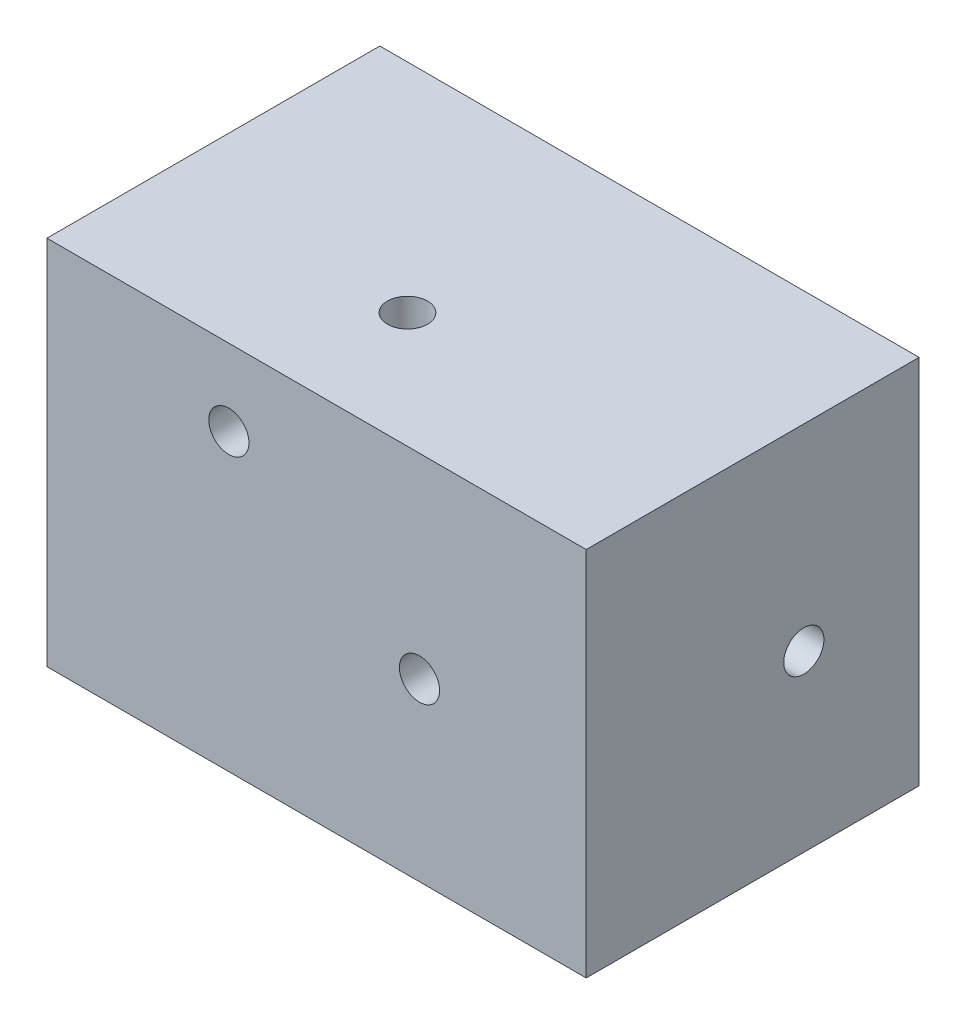
ISO-10303-21;
HEADER;
FILE_DESCRIPTION(('STEP AP214'),'2;1');
FILE_NAME('part.step','',(''),(''),'','','');
FILE_SCHEMA(('AUTOMOTIVE_DESIGN { 1 0 10303 214 1 1 1 1 }'));
ENDSEC;
DATA;
#1=APPLICATION_CONTEXT('core data for automotive mechanical design processes');
#2=APPLICATION_PROTOCOL_DEFINITION('international standard','automotive_design',2000,#1);
#3=PRODUCT_CONTEXT('',#1,'mechanical');
#4=PRODUCT('Part','Part','',(#3));
#5=PRODUCT_RELATED_PRODUCT_CATEGORY('part','',(#4));
#6=PRODUCT_DEFINITION_FORMATION('','',#4);
#7=PRODUCT_DEFINITION_CONTEXT('part definition',#1,'design');
#8=PRODUCT_DEFINITION('design','',#6,#7);
#9=PRODUCT_DEFINITION_SHAPE('','',#8);
#10=(LENGTH_UNIT() NAMED_UNIT(*) SI_UNIT(.MILLI.,.METRE.));
#11=(NAMED_UNIT(*) PLANE_ANGLE_UNIT() SI_UNIT($,.RADIAN.));
#12=(NAMED_UNIT(*) SI_UNIT($,.STERADIAN.) SOLID_ANGLE_UNIT());
#13=UNCERTAINTY_MEASURE_WITH_UNIT(LENGTH_MEASURE(1.E-05),#10,'distance_accuracy_value','');
#14=(GEOMETRIC_REPRESENTATION_CONTEXT(3) GLOBAL_UNCERTAINTY_ASSIGNED_CONTEXT((#13)) GLOBAL_UNIT_ASSIGNED_CONTEXT((#10,
#11,#12)) REPRESENTATION_CONTEXT('',''));
#15=CARTESIAN_POINT('',(0.,0.,0.));
#16=DIRECTION('',(0.,0.,1.));
#17=DIRECTION('',(1.,0.,0.));
#18=AXIS2_PLACEMENT_3D('',#15,#16,#17);
#19=CARTESIAN_POINT('',(-66.51327506726,43.5260781381224,84.5));
#20=DIRECTION('',(1.,0.,0.));
#21=DIRECTION('',(0.,0.,-1.));
#22=AXIS2_PLACEMENT_3D('',#19,#20,#21);
#23=PLANE('',#22);
#24=DIRECTION('',(0.,-1.,0.));
#25=VECTOR('',#24,1.);
#26=CARTESIAN_POINT('',(-66.51327506726,43.5260781381224,0.));
#27=LINE('',#26,#25);
#28=CARTESIAN_POINT('',(-66.51327506726,43.5260781381224,0.));
#29=VERTEX_POINT('',#28);
#30=CARTESIAN_POINT('',(-66.51327506726,-50.6735183376457,0.));
#31=VERTEX_POINT('',#30);
#32=EDGE_CURVE('E169',#29,#31,#27,.T.);
#33=ORIENTED_EDGE('',*,*,#32,.T.);
#34=DIRECTION('',(0.,0.,-1.));
#35=VECTOR('',#34,1.);
#36=CARTESIAN_POINT('',(-66.51327506726,-50.6735183376457,84.5));
#37=LINE('',#36,#35);
#38=CARTESIAN_POINT('',(-66.51327506726,-50.6735183376457,84.5));
#39=VERTEX_POINT('',#38);
#40=EDGE_CURVE('E11',#39,#31,#37,.T.);
#41=ORIENTED_EDGE('',*,*,#40,.F.);
#42=DIRECTION('',(0.,-1.,0.));
#43=VECTOR('',#42,1.);
#44=CARTESIAN_POINT('',(-66.51327506726,43.5260781381224,84.5));
#45=LINE('',#44,#43);
#46=CARTESIAN_POINT('',(-66.51327506726,43.5260781381224,84.5));
#47=VERTEX_POINT('',#46);
#48=EDGE_CURVE('E170',#47,#39,#45,.T.);
#49=ORIENTED_EDGE('',*,*,#48,.F.);
#50=DIRECTION('',(0.,0.,-1.));
#51=VECTOR('',#50,1.);
#52=CARTESIAN_POINT('',(-66.51327506726,43.5260781381224,84.5));
#53=LINE('',#52,#51);
#54=EDGE_CURVE('E176',#47,#29,#53,.T.);
#55=ORIENTED_EDGE('',*,*,#54,.T.);
#56=EDGE_LOOP('',(#33,#41,#49,#55));
#57=FACE_BOUND('',#56,.T.);
#58=ADVANCED_FACE('F41',(#57),#23,.F.);
#59=CARTESIAN_POINT('',(-66.51327506726,-50.6735183376457,84.5));
#60=DIRECTION('',(0.,1.,0.));
#61=DIRECTION('',(0.,0.,1.));
#62=AXIS2_PLACEMENT_3D('',#59,#60,#61);
#63=PLANE('',#62);
#64=DIRECTION('',(1.,0.,0.));
#65=VECTOR('',#64,1.);
#66=CARTESIAN_POINT('',(-66.51327506726,-50.6735183376457,0.));
#67=LINE('',#66,#65);
#68=CARTESIAN_POINT('',(70.387694908224,-50.6735183376457,0.));
#69=VERTEX_POINT('',#68);
#70=EDGE_CURVE('E179',#31,#69,#67,.T.);
#71=ORIENTED_EDGE('',*,*,#70,.T.);
#72=DIRECTION('',(0.,0.,-1.));
#73=VECTOR('',#72,1.);
#74=CARTESIAN_POINT('',(70.387694908224,-50.6735183376457,84.5));
#75=LINE('',#74,#73);
#76=CARTESIAN_POINT('',(70.387694908224,-50.6735183376457,84.5));
#77=VERTEX_POINT('',#76);
#78=EDGE_CURVE('E49',#77,#69,#75,.T.);
#79=ORIENTED_EDGE('',*,*,#78,.F.);
#80=DIRECTION('',(1.,0.,0.));
#81=VECTOR('',#80,1.);
#82=CARTESIAN_POINT('',(-66.51327506726,-50.6735183376457,84.5));
#83=LINE('',#82,#81);
#84=EDGE_CURVE('E88',#39,#77,#83,.T.);
#85=ORIENTED_EDGE('',*,*,#84,.F.);
#86=ORIENTED_EDGE('',*,*,#40,.T.);
#87=EDGE_LOOP('',(#71,#79,#85,#86));
#88=FACE_BOUND('',#87,.T.);
#89=ADVANCED_FACE('F204',(#88),#63,.F.);
#90=CARTESIAN_POINT('',(70.387694908224,43.5260781381224,84.5));
#91=DIRECTION('',(-1.,0.,0.));
#92=DIRECTION('',(0.,0.,1.));
#93=AXIS2_PLACEMENT_3D('',#90,#91,#92);
#94=PLANE('',#93);
#95=CARTESIAN_POINT('',(70.387694908224,-6.39036014197745,29.2573232551136));
#96=DIRECTION('',(1.,0.,0.));
#97=DIRECTION('',(0.,0.,-1.));
#98=AXIS2_PLACEMENT_3D('',#95,#96,#97);
#99=CIRCLE('',#98,5.09999999999999);
#100=CARTESIAN_POINT('',(70.387694908224,-6.39036014197745,24.1573232551136));
#101=VERTEX_POINT('',#100);
#102=EDGE_CURVE('E145',#101,#101,#99,.T.);
#103=ORIENTED_EDGE('',*,*,#102,.F.);
#104=EDGE_LOOP('',(#103));
#105=FACE_BOUND('',#104,.T.);
#106=DIRECTION('',(0.,1.,0.));
#107=VECTOR('',#106,1.);
#108=CARTESIAN_POINT('',(70.387694908224,43.5260781381224,0.));
#109=LINE('',#108,#107);
#110=CARTESIAN_POINT('',(70.387694908224,43.5260781381224,0.));
#111=VERTEX_POINT('',#110);
#112=EDGE_CURVE('E75',#69,#111,#109,.T.);
#113=ORIENTED_EDGE('',*,*,#112,.T.);
#114=DIRECTION('',(0.,0.,-1.));
#115=VECTOR('',#114,1.);
#116=CARTESIAN_POINT('',(70.387694908224,43.5260781381224,84.5));
#117=LINE('',#116,#115);
#118=CARTESIAN_POINT('',(70.387694908224,43.5260781381224,84.5));
#119=VERTEX_POINT('',#118);
#120=EDGE_CURVE('E184',#119,#111,#117,.T.);
#121=ORIENTED_EDGE('',*,*,#120,.F.);
#122=DIRECTION('',(0.,1.,0.));
#123=VECTOR('',#122,1.);
#124=CARTESIAN_POINT('',(70.387694908224,43.5260781381224,84.5));
#125=LINE('',#124,#123);
#126=EDGE_CURVE('E173',#77,#119,#125,.T.);
#127=ORIENTED_EDGE('',*,*,#126,.F.);
#128=ORIENTED_EDGE('',*,*,#78,.T.);
#129=EDGE_LOOP('',(#113,#121,#127,#128));
#130=FACE_BOUND('',#129,.T.);
#131=ADVANCED_FACE('F186',(#105,#130),#94,.F.);
#132=CARTESIAN_POINT('',(-66.51327506726,43.5260781381224,84.5));
#133=DIRECTION('',(0.,-1.,0.));
#134=DIRECTION('',(0.,0.,-1.));
#135=AXIS2_PLACEMENT_3D('',#132,#133,#134);
#136=PLANE('',#135);
#137=CARTESIAN_POINT('',(-4.38123419428039,43.5260781381224,55.1137950806249));
#138=DIRECTION('',(0.,1.,0.));
#139=DIRECTION('',(0.,0.,1.));
#140=AXIS2_PLACEMENT_3D('',#137,#138,#139);
#141=CIRCLE('',#140,5.09999999999999);
#142=CARTESIAN_POINT('',(-4.38123419428039,43.5260781381224,60.2137950806249));
#143=VERTEX_POINT('',#142);
#144=EDGE_CURVE('E458',#143,#143,#141,.T.);
#145=ORIENTED_EDGE('',*,*,#144,.F.);
#146=EDGE_LOOP('',(#145));
#147=FACE_BOUND('',#146,.T.);
#148=DIRECTION('',(-1.,0.,0.));
#149=VECTOR('',#148,1.);
#150=CARTESIAN_POINT('',(-66.51327506726,43.5260781381224,0.));
#151=LINE('',#150,#149);
#152=EDGE_CURVE('E81',#111,#29,#151,.T.);
#153=ORIENTED_EDGE('',*,*,#152,.T.);
#154=ORIENTED_EDGE('',*,*,#54,.F.);
#155=DIRECTION('',(-1.,0.,0.));
#156=VECTOR('',#155,1.);
#157=CARTESIAN_POINT('',(-66.51327506726,43.5260781381224,84.5));
#158=LINE('',#157,#156);
#159=EDGE_CURVE('E57',#119,#47,#158,.T.);
#160=ORIENTED_EDGE('',*,*,#159,.F.);
#161=ORIENTED_EDGE('',*,*,#120,.T.);
#162=EDGE_LOOP('',(#153,#154,#160,#161));
#163=FACE_BOUND('',#162,.T.);
#164=ADVANCED_FACE('F193',(#147,#163),#136,.F.);
#165=CARTESIAN_POINT('',(0.,0.,84.5));
#166=DIRECTION('',(0.,0.,1.));
#167=DIRECTION('',(1.,0.,0.));
#168=AXIS2_PLACEMENT_3D('',#165,#166,#167);
#169=PLANE('',#168);
#170=CARTESIAN_POINT('',(-20.3300547579337,24.1488473211842,84.5));
#171=DIRECTION('',(0.,0.,1.));
#172=DIRECTION('',(1.,0.,0.));
#173=AXIS2_PLACEMENT_3D('',#170,#171,#172);
#174=CIRCLE('',#173,5.09999999999999);
#175=CARTESIAN_POINT('',(-15.2300547579337,24.1488473211842,84.5));
#176=VERTEX_POINT('',#175);
#177=EDGE_CURVE('E114',#176,#176,#174,.T.);
#178=ORIENTED_EDGE('',*,*,#177,.F.);
#179=EDGE_LOOP('',(#178));
#180=FACE_BOUND('',#179,.T.);
#181=CARTESIAN_POINT('',(28.063494867312,-6.10179840808375,84.5));
#182=DIRECTION('',(0.,0.,1.));
#183=DIRECTION('',(1.,0.,0.));
#184=AXIS2_PLACEMENT_3D('',#181,#182,#183);
#185=CIRCLE('',#184,5.09999999999999);
#186=CARTESIAN_POINT('',(33.163494867312,-6.10179840808375,84.5));
#187=VERTEX_POINT('',#186);
#188=EDGE_CURVE('E133',#187,#187,#185,.T.);
#189=ORIENTED_EDGE('',*,*,#188,.F.);
#190=EDGE_LOOP('',(#189));
#191=FACE_BOUND('',#190,.T.);
#192=ORIENTED_EDGE('',*,*,#48,.T.);
#193=ORIENTED_EDGE('',*,*,#84,.T.);
#194=ORIENTED_EDGE('',*,*,#126,.T.);
#195=ORIENTED_EDGE('',*,*,#159,.T.);
#196=EDGE_LOOP('',(#192,#193,#194,#195));
#197=FACE_BOUND('',#196,.T.);
#198=ADVANCED_FACE('F195',(#180,#191,#197),#169,.T.);
#199=CARTESIAN_POINT('',(0.,0.,0.));
#200=DIRECTION('',(0.,0.,1.));
#201=DIRECTION('',(1.,0.,0.));
#202=AXIS2_PLACEMENT_3D('',#199,#200,#201);
#203=PLANE('',#202);
#204=CARTESIAN_POINT('',(37.2930876049268,-19.3920591496213,0.));
#205=DIRECTION('',(0.,0.,-1.));
#206=DIRECTION('',(-1.,0.,0.));
#207=AXIS2_PLACEMENT_3D('',#204,#205,#206);
#208=CIRCLE('',#207,5.09999999999999);
#209=CARTESIAN_POINT('',(32.1930876049268,-19.3920591496213,0.));
#210=VERTEX_POINT('',#209);
#211=EDGE_CURVE('E157',#210,#210,#208,.T.);
#212=ORIENTED_EDGE('',*,*,#211,.F.);
#213=EDGE_LOOP('',(#212));
#214=FACE_BOUND('',#213,.T.);
#215=ORIENTED_EDGE('',*,*,#32,.F.);
#216=ORIENTED_EDGE('',*,*,#152,.F.);
#217=ORIENTED_EDGE('',*,*,#112,.F.);
#218=ORIENTED_EDGE('',*,*,#70,.F.);
#219=EDGE_LOOP('',(#215,#216,#217,#218));
#220=FACE_BOUND('',#219,.T.);
#221=ADVANCED_FACE('F189',(#214,#220),#203,.F.);
#222=CARTESIAN_POINT('',(37.2930876049268,-19.3920591496213,43.5260781381224));
#223=DIRECTION('',(0.,0.,-1.));
#224=DIRECTION('',(-1.,0.,0.));
#225=AXIS2_PLACEMENT_3D('',#222,#223,#224);
#226=CONICAL_SURFACE('',#225,3.38339723340357,0.85821519604501);
#227=CARTESIAN_POINT('',(37.2930876049268,-19.3920591496213,46.449423675881));
#228=VERTEX_POINT('',#227);
#229=VERTEX_LOOP('',#228);
#230=FACE_BOUND('',#229,.T.);
#231=CARTESIAN_POINT('',(37.2930876049268,-19.3920591496213,43.5260781381224));
#232=DIRECTION('',(0.,0.,-1.));
#233=DIRECTION('',(-1.,0.,0.));
#234=AXIS2_PLACEMENT_3D('',#231,#232,#233);
#235=CIRCLE('',#234,3.38339723340357);
#236=CARTESIAN_POINT('',(33.9096903715233,-19.3920591496213,43.5260781381224));
#237=VERTEX_POINT('',#236);
#238=EDGE_CURVE('E166',#237,#237,#235,.T.);
#239=ORIENTED_EDGE('',*,*,#238,.T.);
#240=EDGE_LOOP('',(#239));
#241=FACE_BOUND('',#240,.T.);
#242=ADVANCED_FACE('F238',(#230,#241),#226,.F.);
#243=CARTESIAN_POINT('',(37.2930876049268,-19.3920591496213,0.));
#244=DIRECTION('',(0.,0.,-1.));
#245=DIRECTION('',(-1.,0.,0.));
#246=AXIS2_PLACEMENT_3D('',#243,#244,#245);
#247=CYLINDRICAL_SURFACE('',#246,3.38339723340357);
#248=ORIENTED_EDGE('',*,*,#238,.F.);
#249=EDGE_LOOP('',(#248));
#250=FACE_BOUND('',#249,.T.);
#251=CARTESIAN_POINT('',(37.2930876049268,-19.3920591496213,33.7814390009616));
#252=DIRECTION('',(0.,0.,-1.));
#253=DIRECTION('',(-1.,0.,0.));
#254=AXIS2_PLACEMENT_3D('',#251,#252,#253);
#255=CIRCLE('',#254,3.38339723340357);
#256=CARTESIAN_POINT('',(33.9096903715233,-19.3920591496213,33.7814390009616));
#257=VERTEX_POINT('',#256);
#258=EDGE_CURVE('E163',#257,#257,#255,.T.);
#259=ORIENTED_EDGE('',*,*,#258,.T.);
#260=EDGE_LOOP('',(#259));
#261=FACE_BOUND('',#260,.T.);
#262=ADVANCED_FACE('F247',(#250,#261),#247,.F.);
#263=CARTESIAN_POINT('',(37.2930876049268,-19.3920591496213,32.75));
#264=DIRECTION('',(0.,0.,-1.));
#265=DIRECTION('',(-1.,0.,0.));
#266=AXIS2_PLACEMENT_3D('',#263,#264,#265);
#267=CONICAL_SURFACE('',#266,5.09999999999999,1.02974425867665);
#268=ORIENTED_EDGE('',*,*,#258,.F.);
#269=EDGE_LOOP('',(#268));
#270=FACE_BOUND('',#269,.T.);
#271=CARTESIAN_POINT('',(37.2930876049268,-19.3920591496213,32.75));
#272=DIRECTION('',(0.,0.,-1.));
#273=DIRECTION('',(-1.,0.,0.));
#274=AXIS2_PLACEMENT_3D('',#271,#272,#273);
#275=CIRCLE('',#274,5.09999999999999);
#276=CARTESIAN_POINT('',(32.1930876049268,-19.3920591496213,32.75));
#277=VERTEX_POINT('',#276);
#278=EDGE_CURVE('E160',#277,#277,#275,.T.);
#279=ORIENTED_EDGE('',*,*,#278,.T.);
#280=EDGE_LOOP('',(#279));
#281=FACE_BOUND('',#280,.T.);
#282=ADVANCED_FACE('F257',(#270,#281),#267,.F.);
#283=CARTESIAN_POINT('',(37.2930876049268,-19.3920591496213,0.));
#284=DIRECTION('',(0.,0.,-1.));
#285=DIRECTION('',(-1.,0.,0.));
#286=AXIS2_PLACEMENT_3D('',#283,#284,#285);
#287=CYLINDRICAL_SURFACE('',#286,5.09999999999999);
#288=ORIENTED_EDGE('',*,*,#278,.F.);
#289=EDGE_LOOP('',(#288));
#290=FACE_BOUND('',#289,.T.);
#291=ORIENTED_EDGE('',*,*,#211,.T.);
#292=EDGE_LOOP('',(#291));
#293=FACE_BOUND('',#292,.T.);
#294=ADVANCED_FACE('F267',(#290,#293),#287,.F.);
#295=CARTESIAN_POINT('',(26.8616167701016,-6.39036014197745,29.2573232551136));
#296=DIRECTION('',(1.,0.,0.));
#297=DIRECTION('',(0.,0.,-1.));
#298=AXIS2_PLACEMENT_3D('',#295,#296,#297);
#299=CONICAL_SURFACE('',#298,3.38339723340357,0.85821519604501);
#300=CARTESIAN_POINT('',(23.9382712323431,-6.39036014197745,29.2573232551136));
#301=VERTEX_POINT('',#300);
#302=VERTEX_LOOP('',#301);
#303=FACE_BOUND('',#302,.T.);
#304=CARTESIAN_POINT('',(26.8616167701016,-6.39036014197745,29.2573232551136));
#305=DIRECTION('',(1.,0.,0.));
#306=DIRECTION('',(0.,0.,-1.));
#307=AXIS2_PLACEMENT_3D('',#304,#305,#306);
#308=CIRCLE('',#307,3.38339723340357);
#309=CARTESIAN_POINT('',(26.8616167701016,-6.39036014197745,25.87392602171));
#310=VERTEX_POINT('',#309);
#311=EDGE_CURVE('E154',#310,#310,#308,.T.);
#312=ORIENTED_EDGE('',*,*,#311,.T.);
#313=EDGE_LOOP('',(#312));
#314=FACE_BOUND('',#313,.T.);
#315=ADVANCED_FACE('F278',(#303,#314),#299,.F.);
#316=CARTESIAN_POINT('',(70.387694908224,-6.39036014197745,29.2573232551136));
#317=DIRECTION('',(1.,0.,0.));
#318=DIRECTION('',(0.,0.,-1.));
#319=AXIS2_PLACEMENT_3D('',#316,#317,#318);
#320=CYLINDRICAL_SURFACE('',#319,3.38339723340357);
#321=ORIENTED_EDGE('',*,*,#311,.F.);
#322=EDGE_LOOP('',(#321));
#323=FACE_BOUND('',#322,.T.);
#324=CARTESIAN_POINT('',(36.6062559072625,-6.39036014197745,29.2573232551136));
#325=DIRECTION('',(1.,0.,0.));
#326=DIRECTION('',(0.,0.,-1.));
#327=AXIS2_PLACEMENT_3D('',#324,#325,#326);
#328=CIRCLE('',#327,3.38339723340357);
#329=CARTESIAN_POINT('',(36.6062559072625,-6.39036014197745,25.87392602171));
#330=VERTEX_POINT('',#329);
#331=EDGE_CURVE('E151',#330,#330,#328,.T.);
#332=ORIENTED_EDGE('',*,*,#331,.T.);
#333=EDGE_LOOP('',(#332));
#334=FACE_BOUND('',#333,.T.);
#335=ADVANCED_FACE('F290',(#323,#334),#320,.F.);
#336=CARTESIAN_POINT('',(37.637694908224,-6.39036014197745,29.2573232551136));
#337=DIRECTION('',(1.,0.,0.));
#338=DIRECTION('',(0.,0.,-1.));
#339=AXIS2_PLACEMENT_3D('',#336,#337,#338);
#340=CONICAL_SURFACE('',#339,5.09999999999999,1.02974425867665);
#341=ORIENTED_EDGE('',*,*,#331,.F.);
#342=EDGE_LOOP('',(#341));
#343=FACE_BOUND('',#342,.T.);
#344=CARTESIAN_POINT('',(37.637694908224,-6.39036014197745,29.2573232551136));
#345=DIRECTION('',(1.,0.,0.));
#346=DIRECTION('',(0.,0.,-1.));
#347=AXIS2_PLACEMENT_3D('',#344,#345,#346);
#348=CIRCLE('',#347,5.09999999999999);
#349=CARTESIAN_POINT('',(37.637694908224,-6.39036014197745,24.1573232551136));
#350=VERTEX_POINT('',#349);
#351=EDGE_CURVE('E148',#350,#350,#348,.T.);
#352=ORIENTED_EDGE('',*,*,#351,.T.);
#353=EDGE_LOOP('',(#352));
#354=FACE_BOUND('',#353,.T.);
#355=ADVANCED_FACE('F300',(#343,#354),#340,.F.);
#356=CARTESIAN_POINT('',(70.387694908224,-6.39036014197745,29.2573232551136));
#357=DIRECTION('',(1.,0.,0.));
#358=DIRECTION('',(0.,0.,-1.));
#359=AXIS2_PLACEMENT_3D('',#356,#357,#358);
#360=CYLINDRICAL_SURFACE('',#359,5.09999999999999);
#361=ORIENTED_EDGE('',*,*,#351,.F.);
#362=EDGE_LOOP('',(#361));
#363=FACE_BOUND('',#362,.T.);
#364=ORIENTED_EDGE('',*,*,#102,.T.);
#365=EDGE_LOOP('',(#364));
#366=FACE_BOUND('',#365,.T.);
#367=ADVANCED_FACE('F310',(#363,#366),#360,.F.);
#368=CARTESIAN_POINT('',(28.063494867312,-6.10179840808375,40.9739218618776));
#369=DIRECTION('',(0.,0.,1.));
#370=DIRECTION('',(1.,0.,0.));
#371=AXIS2_PLACEMENT_3D('',#368,#369,#370);
#372=CONICAL_SURFACE('',#371,3.38339723340357,0.85821519604501);
#373=CARTESIAN_POINT('',(28.063494867312,-6.10179840808375,38.050576324119));
#374=VERTEX_POINT('',#373);
#375=VERTEX_LOOP('',#374);
#376=FACE_BOUND('',#375,.T.);
#377=CARTESIAN_POINT('',(28.063494867312,-6.10179840808375,40.9739218618776));
#378=DIRECTION('',(0.,0.,1.));
#379=DIRECTION('',(1.,0.,0.));
#380=AXIS2_PLACEMENT_3D('',#377,#378,#379);
#381=CIRCLE('',#380,3.38339723340357);
#382=CARTESIAN_POINT('',(31.4468921007156,-6.10179840808375,40.9739218618776));
#383=VERTEX_POINT('',#382);
#384=EDGE_CURVE('E142',#383,#383,#381,.T.);
#385=ORIENTED_EDGE('',*,*,#384,.T.);
#386=EDGE_LOOP('',(#385));
#387=FACE_BOUND('',#386,.T.);
#388=ADVANCED_FACE('F320',(#376,#387),#372,.F.);
#389=CARTESIAN_POINT('',(28.063494867312,-6.10179840808375,84.5));
#390=DIRECTION('',(0.,0.,1.));
#391=DIRECTION('',(1.,0.,0.));
#392=AXIS2_PLACEMENT_3D('',#389,#390,#391);
#393=CYLINDRICAL_SURFACE('',#392,3.38339723340357);
#394=ORIENTED_EDGE('',*,*,#384,.F.);
#395=EDGE_LOOP('',(#394));
#396=FACE_BOUND('',#395,.T.);
#397=CARTESIAN_POINT('',(28.063494867312,-6.10179840808375,50.7185609990384));
#398=DIRECTION('',(0.,0.,1.));
#399=DIRECTION('',(1.,0.,0.));
#400=AXIS2_PLACEMENT_3D('',#397,#398,#399);
#401=CIRCLE('',#400,3.38339723340357);
#402=CARTESIAN_POINT('',(31.4468921007156,-6.10179840808375,50.7185609990384));
#403=VERTEX_POINT('',#402);
#404=EDGE_CURVE('E139',#403,#403,#401,.T.);
#405=ORIENTED_EDGE('',*,*,#404,.T.);
#406=EDGE_LOOP('',(#405));
#407=FACE_BOUND('',#406,.T.);
#408=ADVANCED_FACE('F332',(#396,#407),#393,.F.);
#409=CARTESIAN_POINT('',(28.063494867312,-6.10179840808375,51.75));
#410=DIRECTION('',(0.,0.,1.));
#411=DIRECTION('',(1.,0.,0.));
#412=AXIS2_PLACEMENT_3D('',#409,#410,#411);
#413=CONICAL_SURFACE('',#412,5.09999999999999,1.02974425867665);
#414=ORIENTED_EDGE('',*,*,#404,.F.);
#415=EDGE_LOOP('',(#414));
#416=FACE_BOUND('',#415,.T.);
#417=CARTESIAN_POINT('',(28.063494867312,-6.10179840808375,51.75));
#418=DIRECTION('',(0.,0.,1.));
#419=DIRECTION('',(1.,0.,0.));
#420=AXIS2_PLACEMENT_3D('',#417,#418,#419);
#421=CIRCLE('',#420,5.09999999999999);
#422=CARTESIAN_POINT('',(33.163494867312,-6.10179840808375,51.75));
#423=VERTEX_POINT('',#422);
#424=EDGE_CURVE('E136',#423,#423,#421,.T.);
#425=ORIENTED_EDGE('',*,*,#424,.T.);
#426=EDGE_LOOP('',(#425));
#427=FACE_BOUND('',#426,.T.);
#428=ADVANCED_FACE('F342',(#416,#427),#413,.F.);
#429=CARTESIAN_POINT('',(28.063494867312,-6.10179840808375,84.5));
#430=DIRECTION('',(0.,0.,1.));
#431=DIRECTION('',(1.,0.,0.));
#432=AXIS2_PLACEMENT_3D('',#429,#430,#431);
#433=CYLINDRICAL_SURFACE('',#432,5.09999999999999);
#434=ORIENTED_EDGE('',*,*,#424,.F.);
#435=EDGE_LOOP('',(#434));
#436=FACE_BOUND('',#435,.T.);
#437=ORIENTED_EDGE('',*,*,#188,.T.);
#438=EDGE_LOOP('',(#437));
#439=FACE_BOUND('',#438,.T.);
#440=ADVANCED_FACE('F352',(#436,#439),#433,.F.);
#441=CARTESIAN_POINT('',(-20.3300547579337,24.1488473211842,40.9739218618776));
#442=DIRECTION('',(0.,0.,1.));
#443=DIRECTION('',(1.,0.,0.));
#444=AXIS2_PLACEMENT_3D('',#441,#442,#443);
#445=CONICAL_SURFACE('',#444,3.38339723340357,0.85821519604501);
#446=CARTESIAN_POINT('',(-20.3300547579337,24.1488473211842,38.050576324119));
#447=VERTEX_POINT('',#446);
#448=VERTEX_LOOP('',#447);
#449=FACE_BOUND('',#448,.T.);
#450=CARTESIAN_POINT('',(-20.3300547579337,24.1488473211842,40.9739218618776));
#451=DIRECTION('',(0.,0.,1.));
#452=DIRECTION('',(1.,0.,0.));
#453=AXIS2_PLACEMENT_3D('',#450,#451,#452);
#454=CIRCLE('',#453,3.38339723340357);
#455=CARTESIAN_POINT('',(-16.9466575245301,24.1488473211842,40.9739218618776));
#456=VERTEX_POINT('',#455);
#457=EDGE_CURVE('E130',#456,#456,#454,.T.);
#458=ORIENTED_EDGE('',*,*,#457,.T.);
#459=EDGE_LOOP('',(#458));
#460=FACE_BOUND('',#459,.T.);
#461=ADVANCED_FACE('F362',(#449,#460),#445,.F.);
#462=CARTESIAN_POINT('',(-20.3300547579337,24.1488473211842,84.5));
#463=DIRECTION('',(0.,0.,1.));
#464=DIRECTION('',(1.,0.,0.));
#465=AXIS2_PLACEMENT_3D('',#462,#463,#464);
#466=CYLINDRICAL_SURFACE('',#465,3.38339723340357);
#467=ORIENTED_EDGE('',*,*,#457,.F.);
#468=EDGE_LOOP('',(#467));
#469=FACE_BOUND('',#468,.T.);
#470=CARTESIAN_POINT('',(-20.3300547579337,24.1488473211842,50.7185609990384));
#471=DIRECTION('',(0.,0.,1.));
#472=DIRECTION('',(1.,0.,0.));
#473=AXIS2_PLACEMENT_3D('',#470,#471,#472);
#474=CIRCLE('',#473,3.38339723340357);
#475=CARTESIAN_POINT('',(-16.9466575245301,24.1488473211842,50.7185609990384));
#476=VERTEX_POINT('',#475);
#477=EDGE_CURVE('E127',#476,#476,#474,.T.);
#478=ORIENTED_EDGE('',*,*,#477,.T.);
#479=EDGE_LOOP('',(#478));
#480=FACE_BOUND('',#479,.T.);
#481=ADVANCED_FACE('F374',(#469,#480),#466,.F.);
#482=CARTESIAN_POINT('',(-20.3300547579337,24.1488473211842,51.75));
#483=DIRECTION('',(0.,0.,1.));
#484=DIRECTION('',(1.,0.,0.));
#485=AXIS2_PLACEMENT_3D('',#482,#483,#484);
#486=CONICAL_SURFACE('',#485,5.09999999999999,1.02974425867665);
#487=ORIENTED_EDGE('',*,*,#477,.F.);
#488=EDGE_LOOP('',(#487));
#489=FACE_BOUND('',#488,.T.);
#490=CARTESIAN_POINT('',(-20.3300547579337,24.1488473211842,51.75));
#491=DIRECTION('',(0.,0.,1.));
#492=DIRECTION('',(1.,0.,0.));
#493=AXIS2_PLACEMENT_3D('',#490,#491,#492);
#494=CIRCLE('',#493,5.09999999999999);
#495=CARTESIAN_POINT('',(-15.2300547579337,24.1488473211842,51.75));
#496=VERTEX_POINT('',#495);
#497=EDGE_CURVE('E118',#496,#496,#494,.T.);
#498=ORIENTED_EDGE('',*,*,#497,.T.);
#499=EDGE_LOOP('',(#498));
#500=FACE_BOUND('',#499,.T.);
#501=ADVANCED_FACE('F384',(#489,#500),#486,.F.);
#502=CARTESIAN_POINT('',(-20.3300547579337,24.1488473211842,84.5));
#503=DIRECTION('',(0.,0.,1.));
#504=DIRECTION('',(1.,0.,0.));
#505=AXIS2_PLACEMENT_3D('',#502,#503,#504);
#506=CYLINDRICAL_SURFACE('',#505,5.09999999999999);
#507=ORIENTED_EDGE('',*,*,#497,.F.);
#508=EDGE_LOOP('',(#507));
#509=FACE_BOUND('',#508,.T.);
#510=ORIENTED_EDGE('',*,*,#177,.T.);
#511=EDGE_LOOP('',(#510));
#512=FACE_BOUND('',#511,.T.);
#513=ADVANCED_FACE('F108',(#509,#512),#506,.F.);
#514=CARTESIAN_POINT('',(-4.38123419428039,0.,55.1137950806249));
#515=DIRECTION('',(0.,1.,0.));
#516=DIRECTION('',(0.,0.,1.));
#517=AXIS2_PLACEMENT_3D('',#514,#515,#516);
#518=CONICAL_SURFACE('',#517,3.38339723340357,0.85821519604501);
#519=CARTESIAN_POINT('',(-4.38123419428039,-2.92334553775857,55.1137950806249));
#520=VERTEX_POINT('',#519);
#521=VERTEX_LOOP('',#520);
#522=FACE_BOUND('',#521,.T.);
#523=CARTESIAN_POINT('',(-4.38123419428039,0.,55.1137950806249));
#524=DIRECTION('',(0.,1.,0.));
#525=DIRECTION('',(0.,0.,1.));
#526=AXIS2_PLACEMENT_3D('',#523,#524,#525);
#527=CIRCLE('',#526,3.38339723340357);
#528=CARTESIAN_POINT('',(-4.38123419428039,0.,58.4971923140285));
#529=VERTEX_POINT('',#528);
#530=EDGE_CURVE('E112',#529,#529,#527,.T.);
#531=ORIENTED_EDGE('',*,*,#530,.T.);
#532=EDGE_LOOP('',(#531));
#533=FACE_BOUND('',#532,.T.);
#534=ADVANCED_FACE('F104',(#522,#533),#518,.F.);
#535=CARTESIAN_POINT('',(-4.38123419428039,43.5260781381224,55.1137950806249));
#536=DIRECTION('',(0.,1.,0.));
#537=DIRECTION('',(0.,0.,1.));
#538=AXIS2_PLACEMENT_3D('',#535,#536,#537);
#539=CYLINDRICAL_SURFACE('',#538,3.38339723340357);
#540=ORIENTED_EDGE('',*,*,#530,.F.);
#541=EDGE_LOOP('',(#540));
#542=FACE_BOUND('',#541,.T.);
#543=CARTESIAN_POINT('',(-4.38123419428039,9.74463913716087,55.1137950806249));
#544=DIRECTION('',(0.,1.,0.));
#545=DIRECTION('',(0.,0.,1.));
#546=AXIS2_PLACEMENT_3D('',#543,#544,#545);
#547=CIRCLE('',#546,3.38339723340357);
#548=CARTESIAN_POINT('',(-4.38123419428039,9.74463913716087,58.4971923140285));
#549=VERTEX_POINT('',#548);
#550=EDGE_CURVE('E115',#549,#549,#547,.T.);
#551=ORIENTED_EDGE('',*,*,#550,.T.);
#552=EDGE_LOOP('',(#551));
#553=FACE_BOUND('',#552,.T.);
#554=ADVANCED_FACE('F107',(#542,#553),#539,.F.);
#555=CARTESIAN_POINT('',(-4.38123419428039,10.7760781381224,55.1137950806249));
#556=DIRECTION('',(0.,1.,0.));
#557=DIRECTION('',(0.,0.,1.));
#558=AXIS2_PLACEMENT_3D('',#555,#556,#557);
#559=CONICAL_SURFACE('',#558,5.09999999999999,1.02974425867665);
#560=ORIENTED_EDGE('',*,*,#550,.F.);
#561=EDGE_LOOP('',(#560));
#562=FACE_BOUND('',#561,.T.);
#563=CARTESIAN_POINT('',(-4.38123419428039,10.7760781381224,55.1137950806249));
#564=DIRECTION('',(0.,1.,0.));
#565=DIRECTION('',(0.,0.,1.));
#566=AXIS2_PLACEMENT_3D('',#563,#564,#565);
#567=CIRCLE('',#566,5.09999999999999);
#568=CARTESIAN_POINT('',(-4.38123419428039,10.7760781381224,60.2137950806249));
#569=VERTEX_POINT('',#568);
#570=EDGE_CURVE('E121',#569,#569,#567,.T.);
#571=ORIENTED_EDGE('',*,*,#570,.T.);
#572=EDGE_LOOP('',(#571));
#573=FACE_BOUND('',#572,.T.);
#574=ADVANCED_FACE('F420',(#562,#573),#559,.F.);
#575=CARTESIAN_POINT('',(-4.38123419428039,43.5260781381224,55.1137950806249));
#576=DIRECTION('',(0.,1.,0.));
#577=DIRECTION('',(0.,0.,1.));
#578=AXIS2_PLACEMENT_3D('',#575,#576,#577);
#579=CYLINDRICAL_SURFACE('',#578,5.09999999999999);
#580=ORIENTED_EDGE('',*,*,#570,.F.);
#581=EDGE_LOOP('',(#580));
#582=FACE_BOUND('',#581,.T.);
#583=ORIENTED_EDGE('',*,*,#144,.T.);
#584=EDGE_LOOP('',(#583));
#585=FACE_BOUND('',#584,.T.);
#586=ADVANCED_FACE('F429',(#582,#585),#579,.F.);
#587=CLOSED_SHELL('',(#58,#89,#131,#164,#198,#221,#242,#262,#282,#294,#315,#335,#355,#367,#388,
#408,#428,#440,#461,#481,#501,#513,#534,#554,#574,#586));
#588=MANIFOLD_SOLID_BREP('B2',#587);
#589=ADVANCED_BREP_SHAPE_REPRESENTATION('',(#18,#588),#14);
#590=SHAPE_DEFINITION_REPRESENTATION(#9,#589);
ENDSEC;
END-ISO-10303-21;
